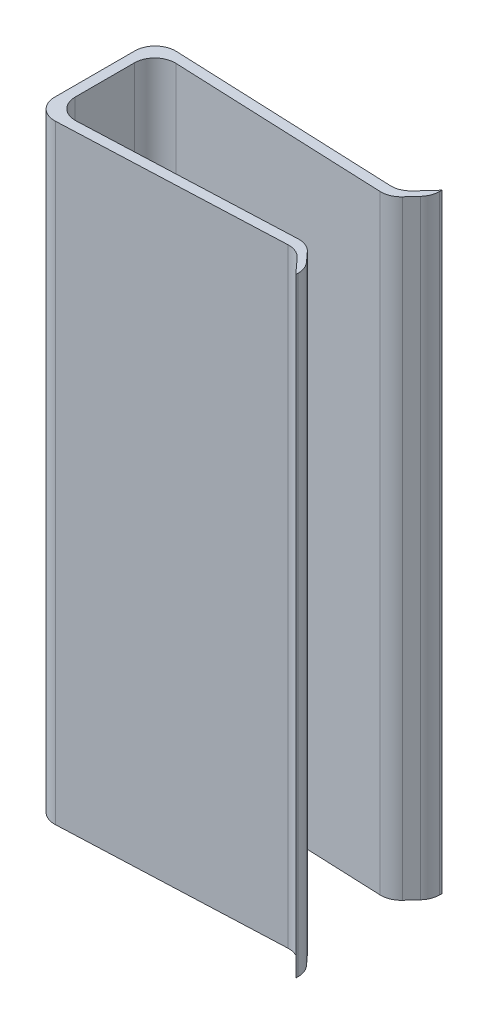
ISO-10303-21;
HEADER;
FILE_DESCRIPTION(('STEP AP214'),'2;1');
FILE_NAME('part.step','',(''),(''),'','','');
FILE_SCHEMA(('AUTOMOTIVE_DESIGN { 1 0 10303 214 1 1 1 1 }'));
ENDSEC;
DATA;
#1=APPLICATION_CONTEXT('core data for automotive mechanical design processes');
#2=APPLICATION_PROTOCOL_DEFINITION('international standard','automotive_design',2000,#1);
#3=PRODUCT_CONTEXT('',#1,'mechanical');
#4=PRODUCT('Part','Part','',(#3));
#5=PRODUCT_RELATED_PRODUCT_CATEGORY('part','',(#4));
#6=PRODUCT_DEFINITION_FORMATION('','',#4);
#7=PRODUCT_DEFINITION_CONTEXT('part definition',#1,'design');
#8=PRODUCT_DEFINITION('design','',#6,#7);
#9=PRODUCT_DEFINITION_SHAPE('','',#8);
#10=(LENGTH_UNIT() NAMED_UNIT(*) SI_UNIT(.MILLI.,.METRE.));
#11=(NAMED_UNIT(*) PLANE_ANGLE_UNIT() SI_UNIT($,.RADIAN.));
#12=(NAMED_UNIT(*) SI_UNIT($,.STERADIAN.) SOLID_ANGLE_UNIT());
#13=UNCERTAINTY_MEASURE_WITH_UNIT(LENGTH_MEASURE(1.E-05),#10,'distance_accuracy_value','');
#14=(GEOMETRIC_REPRESENTATION_CONTEXT(3) GLOBAL_UNCERTAINTY_ASSIGNED_CONTEXT((#13)) GLOBAL_UNIT_ASSIGNED_CONTEXT((#10,
#11,#12)) REPRESENTATION_CONTEXT('',''));
#15=CARTESIAN_POINT('',(0.,0.,0.));
#16=DIRECTION('',(0.,0.,1.));
#17=DIRECTION('',(1.,0.,0.));
#18=AXIS2_PLACEMENT_3D('',#15,#16,#17);
#19=CARTESIAN_POINT('',(6.,30.,2.5));
#20=DIRECTION('',(-0.0416305447121811,0.,-0.999133073092352));
#21=DIRECTION('',(-0.999133073092352,0.,0.0416305447121812));
#22=AXIS2_PLACEMENT_3D('',#19,#20,#21);
#23=PLANE('',#22);
#24=DIRECTION('',(0.999133073092352,0.,-0.0416305447121811));
#25=VECTOR('',#24,1.);
#26=CARTESIAN_POINT('',(6.,0.,2.5));
#27=LINE('',#26,#25);
#28=CARTESIAN_POINT('',(-5.45836945528782,0.,2.97743206063699));
#29=VERTEX_POINT('',#28);
#30=CARTESIAN_POINT('',(5.5340965965011,0.,2.51941264181245));
#31=VERTEX_POINT('',#30);
#32=EDGE_CURVE('E237',#29,#31,#27,.T.);
#33=ORIENTED_EDGE('',*,*,#32,.T.);
#34=DIRECTION('',(0.,-1.,0.));
#35=VECTOR('',#34,1.);
#36=CARTESIAN_POINT('',(5.5340965965011,30.,2.51941264181245));
#37=LINE('',#36,#35);
#38=CARTESIAN_POINT('',(5.5340965965011,30.,2.51941264181245));
#39=VERTEX_POINT('',#38);
#40=EDGE_CURVE('E326',#31,#39,#37,.F.);
#41=ORIENTED_EDGE('',*,*,#40,.T.);
#42=DIRECTION('',(0.999133073092352,0.,-0.0416305447121811));
#43=VECTOR('',#42,1.);
#44=CARTESIAN_POINT('',(6.,30.,2.5));
#45=LINE('',#44,#43);
#46=CARTESIAN_POINT('',(-5.45836945528782,30.,2.97743206063699));
#47=VERTEX_POINT('',#46);
#48=EDGE_CURVE('E195',#47,#39,#45,.T.);
#49=ORIENTED_EDGE('',*,*,#48,.F.);
#50=DIRECTION('',(0.,-1.,0.));
#51=VECTOR('',#50,1.);
#52=CARTESIAN_POINT('',(-5.45836945528782,30.,2.97743206063699));
#53=LINE('',#52,#51);
#54=EDGE_CURVE('E323',#47,#29,#53,.T.);
#55=ORIENTED_EDGE('',*,*,#54,.T.);
#56=EDGE_LOOP('',(#33,#41,#49,#55));
#57=FACE_BOUND('',#56,.T.);
#58=ADVANCED_FACE('F33',(#57),#23,.F.);
#59=CARTESIAN_POINT('',(7.,30.,3.59567943020749));
#60=DIRECTION('',(0.738620740253294,0.,-0.67412120725258));
#61=DIRECTION('',(-0.67412120725258,0.,-0.738620740253294));
#62=AXIS2_PLACEMENT_3D('',#59,#60,#61);
#63=PLANE('',#62);
#64=DIRECTION('',(0.67412120725258,0.,0.738620740253294));
#65=VECTOR('',#64,1.);
#66=CARTESIAN_POINT('',(7.,30.,3.59567943020749));
#67=LINE('',#66,#65);
#68=CARTESIAN_POINT('',(6.31434788146657,30.,2.84442450765223));
#69=VERTEX_POINT('',#68);
#70=CARTESIAN_POINT('',(7.,30.,3.59567943020749));
#71=VERTEX_POINT('',#70);
#72=EDGE_CURVE('E182',#69,#71,#67,.T.);
#73=ORIENTED_EDGE('',*,*,#72,.F.);
#74=DIRECTION('',(0.,-1.,0.));
#75=VECTOR('',#74,1.);
#76=CARTESIAN_POINT('',(6.31434788146657,0.,2.84442450765223));
#77=LINE('',#76,#75);
#78=CARTESIAN_POINT('',(6.31434788146657,0.,2.84442450765223));
#79=VERTEX_POINT('',#78);
#80=EDGE_CURVE('E321',#69,#79,#77,.T.);
#81=ORIENTED_EDGE('',*,*,#80,.T.);
#82=DIRECTION('',(0.67412120725258,0.,0.738620740253294));
#83=VECTOR('',#82,1.);
#84=CARTESIAN_POINT('',(7.,0.,3.59567943020749));
#85=LINE('',#84,#83);
#86=CARTESIAN_POINT('',(7.,0.,3.59567943020749));
#87=VERTEX_POINT('',#86);
#88=EDGE_CURVE('E201',#79,#87,#85,.T.);
#89=ORIENTED_EDGE('',*,*,#88,.T.);
#90=DIRECTION('',(0.,-1.,0.));
#91=VECTOR('',#90,1.);
#92=CARTESIAN_POINT('',(7.,30.,3.59567943020749));
#93=LINE('',#92,#91);
#94=EDGE_CURVE('E198',#71,#87,#93,.T.);
#95=ORIENTED_EDGE('',*,*,#94,.F.);
#96=EDGE_LOOP('',(#73,#81,#89,#95));
#97=FACE_BOUND('',#96,.T.);
#98=ADVANCED_FACE('F199',(#97),#63,.F.);
#99=CARTESIAN_POINT('',(7.,30.,3.09567943020749));
#100=DIRECTION('',(-1.,0.,0.));
#101=DIRECTION('',(0.,0.,1.));
#102=AXIS2_PLACEMENT_3D('',#99,#100,#101);
#103=PLANE('',#102);
#104=DIRECTION('',(0.,0.,-1.));
#105=VECTOR('',#104,1.);
#106=CARTESIAN_POINT('',(7.,0.,3.09567943020749));
#107=LINE('',#106,#105);
#108=CARTESIAN_POINT('',(7.,0.,3.48341275907275));
#109=VERTEX_POINT('',#108);
#110=EDGE_CURVE('E241',#87,#109,#107,.T.);
#111=ORIENTED_EDGE('',*,*,#110,.T.);
#112=DIRECTION('',(0.,-1.,0.));
#113=VECTOR('',#112,1.);
#114=CARTESIAN_POINT('',(7.,30.,3.48341275907275));
#115=LINE('',#114,#113);
#116=CARTESIAN_POINT('',(7.,30.,3.48341275907275));
#117=VERTEX_POINT('',#116);
#118=EDGE_CURVE('E210',#109,#117,#115,.F.);
#119=ORIENTED_EDGE('',*,*,#118,.T.);
#120=DIRECTION('',(0.,0.,-1.));
#121=VECTOR('',#120,1.);
#122=CARTESIAN_POINT('',(7.,30.,3.09567943020749));
#123=LINE('',#122,#121);
#124=EDGE_CURVE('E187',#71,#117,#123,.T.);
#125=ORIENTED_EDGE('',*,*,#124,.F.);
#126=ORIENTED_EDGE('',*,*,#94,.T.);
#127=EDGE_LOOP('',(#111,#119,#125,#126));
#128=FACE_BOUND('',#127,.T.);
#129=ADVANCED_FACE('F208',(#128),#103,.F.);
#130=CARTESIAN_POINT('',(6.,30.,2.));
#131=DIRECTION('',(-0.738620740253294,0.,0.67412120725258));
#132=DIRECTION('',(0.67412120725258,0.,0.738620740253294));
#133=AXIS2_PLACEMENT_3D('',#130,#131,#132);
#134=PLANE('',#133);
#135=DIRECTION('',(-0.67412120725258,0.,-0.738620740253294));
#136=VECTOR('',#135,1.);
#137=CARTESIAN_POINT('',(6.,0.,2.));
#138=LINE('',#137,#136);
#139=CARTESIAN_POINT('',(6.73862074025329,0.,2.80929155182017));
#140=VERTEX_POINT('',#139);
#141=CARTESIAN_POINT('',(6.31434788146657,0.,2.34442450765223));
#142=VERTEX_POINT('',#141);
#143=EDGE_CURVE('E243',#140,#142,#138,.T.);
#144=ORIENTED_EDGE('',*,*,#143,.T.);
#145=DIRECTION('',(0.,-1.,0.));
#146=VECTOR('',#145,1.);
#147=CARTESIAN_POINT('',(6.31434788146657,30.,2.34442450765223));
#148=LINE('',#147,#146);
#149=CARTESIAN_POINT('',(6.31434788146657,30.,2.34442450765223));
#150=VERTEX_POINT('',#149);
#151=EDGE_CURVE('E299',#142,#150,#148,.F.);
#152=ORIENTED_EDGE('',*,*,#151,.T.);
#153=DIRECTION('',(-0.67412120725258,0.,-0.738620740253294));
#154=VECTOR('',#153,1.);
#155=CARTESIAN_POINT('',(6.,30.,2.));
#156=LINE('',#155,#154);
#157=CARTESIAN_POINT('',(6.73862074025329,30.,2.80929155182017));
#158=VERTEX_POINT('',#157);
#159=EDGE_CURVE('E211',#158,#150,#156,.T.);
#160=ORIENTED_EDGE('',*,*,#159,.F.);
#161=DIRECTION('',(0.,-1.,0.));
#162=VECTOR('',#161,1.);
#163=CARTESIAN_POINT('',(6.73862074025329,30.,2.80929155182017));
#164=LINE('',#163,#162);
#165=EDGE_CURVE('E296',#158,#140,#164,.T.);
#166=ORIENTED_EDGE('',*,*,#165,.T.);
#167=EDGE_LOOP('',(#144,#152,#160,#166));
#168=FACE_BOUND('',#167,.T.);
#169=ADVANCED_FACE('F389',(#168),#134,.F.);
#170=CARTESIAN_POINT('',(-6.,30.,2.5));
#171=DIRECTION('',(0.0416305447121813,0.,0.999133073092352));
#172=DIRECTION('',(0.999133073092352,0.,-0.0416305447121813));
#173=AXIS2_PLACEMENT_3D('',#170,#171,#172);
#174=PLANE('',#173);
#175=DIRECTION('',(-0.999133073092352,0.,0.0416305447121813));
#176=VECTOR('',#175,1.);
#177=CARTESIAN_POINT('',(-6.,0.,2.5));
#178=LINE('',#177,#176);
#179=CARTESIAN_POINT('',(5.5340965965011,0.,2.01941264181245));
#180=VERTEX_POINT('',#179);
#181=CARTESIAN_POINT('',(-4.95836945528782,0.,2.45659872730366));
#182=VERTEX_POINT('',#181);
#183=EDGE_CURVE('E246',#180,#182,#178,.T.);
#184=ORIENTED_EDGE('',*,*,#183,.T.);
#185=DIRECTION('',(0.,-1.,0.));
#186=VECTOR('',#185,1.);
#187=CARTESIAN_POINT('',(-4.95836945528782,30.,2.45659872730366));
#188=LINE('',#187,#186);
#189=CARTESIAN_POINT('',(-4.95836945528782,30.,2.45659872730366));
#190=VERTEX_POINT('',#189);
#191=EDGE_CURVE('E277',#182,#190,#188,.F.);
#192=ORIENTED_EDGE('',*,*,#191,.T.);
#193=DIRECTION('',(-0.999133073092352,0.,0.0416305447121813));
#194=VECTOR('',#193,1.);
#195=CARTESIAN_POINT('',(-6.,30.,2.5));
#196=LINE('',#195,#194);
#197=CARTESIAN_POINT('',(5.5340965965011,30.,2.01941264181245));
#198=VERTEX_POINT('',#197);
#199=EDGE_CURVE('E213',#198,#190,#196,.T.);
#200=ORIENTED_EDGE('',*,*,#199,.F.);
#201=DIRECTION('',(0.,-1.,0.));
#202=VECTOR('',#201,1.);
#203=CARTESIAN_POINT('',(5.5340965965011,30.,2.01941264181245));
#204=LINE('',#203,#202);
#205=EDGE_CURVE('E274',#198,#180,#204,.T.);
#206=ORIENTED_EDGE('',*,*,#205,.T.);
#207=EDGE_LOOP('',(#184,#192,#200,#206));
#208=FACE_BOUND('',#207,.T.);
#209=ADVANCED_FACE('F397',(#208),#174,.F.);
#210=CARTESIAN_POINT('',(-6.,30.,2.5));
#211=DIRECTION('',(-1.,0.,0.));
#212=DIRECTION('',(0.,0.,1.));
#213=AXIS2_PLACEMENT_3D('',#210,#211,#212);
#214=PLANE('',#213);
#215=DIRECTION('',(0.,0.,-1.));
#216=VECTOR('',#215,1.);
#217=CARTESIAN_POINT('',(-6.,30.,2.5));
#218=LINE('',#217,#216);
#219=CARTESIAN_POINT('',(-6.,30.,1.45746565421131));
#220=VERTEX_POINT('',#219);
#221=CARTESIAN_POINT('',(-6.,30.,-1.45746565421131));
#222=VERTEX_POINT('',#221);
#223=EDGE_CURVE('E219',#220,#222,#218,.T.);
#224=ORIENTED_EDGE('',*,*,#223,.F.);
#225=DIRECTION('',(0.,-1.,0.));
#226=VECTOR('',#225,1.);
#227=CARTESIAN_POINT('',(-6.,0.,1.45746565421131));
#228=LINE('',#227,#226);
#229=CARTESIAN_POINT('',(-6.,0.,1.45746565421131));
#230=VERTEX_POINT('',#229);
#231=EDGE_CURVE('E271',#220,#230,#228,.T.);
#232=ORIENTED_EDGE('',*,*,#231,.T.);
#233=DIRECTION('',(0.,0.,-1.));
#234=VECTOR('',#233,1.);
#235=CARTESIAN_POINT('',(-6.,0.,2.5));
#236=LINE('',#235,#234);
#237=CARTESIAN_POINT('',(-6.,0.,-1.45746565421131));
#238=VERTEX_POINT('',#237);
#239=EDGE_CURVE('E249',#230,#238,#236,.T.);
#240=ORIENTED_EDGE('',*,*,#239,.T.);
#241=DIRECTION('',(0.,-1.,0.));
#242=VECTOR('',#241,1.);
#243=CARTESIAN_POINT('',(-6.,30.,-1.45746565421131));
#244=LINE('',#243,#242);
#245=EDGE_CURVE('E205',#238,#222,#244,.F.);
#246=ORIENTED_EDGE('',*,*,#245,.T.);
#247=EDGE_LOOP('',(#224,#232,#240,#246));
#248=FACE_BOUND('',#247,.T.);
#249=ADVANCED_FACE('F405',(#248),#214,.F.);
#250=CARTESIAN_POINT('',(-6.,30.,-2.5));
#251=DIRECTION('',(0.0416305447121813,0.,-0.999133073092352));
#252=DIRECTION('',(-0.999133073092352,0.,-0.0416305447121813));
#253=AXIS2_PLACEMENT_3D('',#250,#251,#252);
#254=PLANE('',#253);
#255=DIRECTION('',(0.999133073092352,0.,0.0416305447121813));
#256=VECTOR('',#255,1.);
#257=CARTESIAN_POINT('',(-6.,30.,-2.5));
#258=LINE('',#257,#256);
#259=CARTESIAN_POINT('',(-4.95836945528782,30.,-2.45659872730366));
#260=VERTEX_POINT('',#259);
#261=CARTESIAN_POINT('',(5.5340965965011,30.,-2.01941264181245));
#262=VERTEX_POINT('',#261);
#263=EDGE_CURVE('E222',#260,#262,#258,.T.);
#264=ORIENTED_EDGE('',*,*,#263,.F.);
#265=DIRECTION('',(0.,-1.,0.));
#266=VECTOR('',#265,1.);
#267=CARTESIAN_POINT('',(-4.95836945528782,0.,-2.45659872730366));
#268=LINE('',#267,#266);
#269=CARTESIAN_POINT('',(-4.95836945528782,0.,-2.45659872730366));
#270=VERTEX_POINT('',#269);
#271=EDGE_CURVE('E281',#260,#270,#268,.T.);
#272=ORIENTED_EDGE('',*,*,#271,.T.);
#273=DIRECTION('',(0.999133073092352,0.,0.0416305447121813));
#274=VECTOR('',#273,1.);
#275=CARTESIAN_POINT('',(-6.,0.,-2.5));
#276=LINE('',#275,#274);
#277=CARTESIAN_POINT('',(5.5340965965011,0.,-2.01941264181245));
#278=VERTEX_POINT('',#277);
#279=EDGE_CURVE('E252',#270,#278,#276,.T.);
#280=ORIENTED_EDGE('',*,*,#279,.T.);
#281=DIRECTION('',(0.,-1.,0.));
#282=VECTOR('',#281,1.);
#283=CARTESIAN_POINT('',(5.5340965965011,30.,-2.01941264181245));
#284=LINE('',#283,#282);
#285=EDGE_CURVE('E279',#278,#262,#284,.F.);
#286=ORIENTED_EDGE('',*,*,#285,.T.);
#287=EDGE_LOOP('',(#264,#272,#280,#286));
#288=FACE_BOUND('',#287,.T.);
#289=ADVANCED_FACE('F414',(#288),#254,.F.);
#290=CARTESIAN_POINT('',(6.,30.,-2.));
#291=DIRECTION('',(-0.738620740253294,0.,-0.67412120725258));
#292=DIRECTION('',(-0.67412120725258,0.,0.738620740253294));
#293=AXIS2_PLACEMENT_3D('',#290,#291,#292);
#294=PLANE('',#293);
#295=DIRECTION('',(0.67412120725258,0.,-0.738620740253294));
#296=VECTOR('',#295,1.);
#297=CARTESIAN_POINT('',(6.,0.,-2.));
#298=LINE('',#297,#296);
#299=CARTESIAN_POINT('',(6.31434788146657,0.,-2.34442450765223));
#300=VERTEX_POINT('',#299);
#301=CARTESIAN_POINT('',(6.73862074025329,0.,-2.80929155182017));
#302=VERTEX_POINT('',#301);
#303=EDGE_CURVE('E255',#300,#302,#298,.T.);
#304=ORIENTED_EDGE('',*,*,#303,.T.);
#305=DIRECTION('',(0.,-1.,0.));
#306=VECTOR('',#305,1.);
#307=CARTESIAN_POINT('',(6.73862074025329,30.,-2.80929155182017));
#308=LINE('',#307,#306);
#309=CARTESIAN_POINT('',(6.73862074025329,30.,-2.80929155182017));
#310=VERTEX_POINT('',#309);
#311=EDGE_CURVE('E318',#302,#310,#308,.F.);
#312=ORIENTED_EDGE('',*,*,#311,.T.);
#313=DIRECTION('',(0.67412120725258,0.,-0.738620740253294));
#314=VECTOR('',#313,1.);
#315=CARTESIAN_POINT('',(6.,30.,-2.));
#316=LINE('',#315,#314);
#317=CARTESIAN_POINT('',(6.31434788146657,30.,-2.34442450765223));
#318=VERTEX_POINT('',#317);
#319=EDGE_CURVE('E225',#318,#310,#316,.T.);
#320=ORIENTED_EDGE('',*,*,#319,.F.);
#321=DIRECTION('',(0.,-1.,0.));
#322=VECTOR('',#321,1.);
#323=CARTESIAN_POINT('',(6.31434788146657,30.,-2.34442450765223));
#324=LINE('',#323,#322);
#325=EDGE_CURVE('E315',#318,#300,#324,.T.);
#326=ORIENTED_EDGE('',*,*,#325,.T.);
#327=EDGE_LOOP('',(#304,#312,#320,#326));
#328=FACE_BOUND('',#327,.T.);
#329=ADVANCED_FACE('F423',(#328),#294,.F.);
#330=CARTESIAN_POINT('',(7.,30.,-3.09567943020749));
#331=DIRECTION('',(-1.,0.,0.));
#332=DIRECTION('',(0.,0.,1.));
#333=AXIS2_PLACEMENT_3D('',#330,#331,#332);
#334=PLANE('',#333);
#335=DIRECTION('',(0.,0.,-1.));
#336=VECTOR('',#335,1.);
#337=CARTESIAN_POINT('',(7.,30.,-3.09567943020749));
#338=LINE('',#337,#336);
#339=CARTESIAN_POINT('',(7.,30.,-3.48341275907275));
#340=VERTEX_POINT('',#339);
#341=CARTESIAN_POINT('',(7.,30.,-3.59567943020749));
#342=VERTEX_POINT('',#341);
#343=EDGE_CURVE('E228',#340,#342,#338,.T.);
#344=ORIENTED_EDGE('',*,*,#343,.F.);
#345=DIRECTION('',(0.,-1.,0.));
#346=VECTOR('',#345,1.);
#347=CARTESIAN_POINT('',(7.,30.,-3.48341275907275));
#348=LINE('',#347,#346);
#349=CARTESIAN_POINT('',(7.,0.,-3.48341275907275));
#350=VERTEX_POINT('',#349);
#351=EDGE_CURVE('E312',#340,#350,#348,.T.);
#352=ORIENTED_EDGE('',*,*,#351,.T.);
#353=DIRECTION('',(0.,0.,-1.));
#354=VECTOR('',#353,1.);
#355=CARTESIAN_POINT('',(7.,0.,-3.09567943020749));
#356=LINE('',#355,#354);
#357=CARTESIAN_POINT('',(7.,0.,-3.59567943020749));
#358=VERTEX_POINT('',#357);
#359=EDGE_CURVE('E258',#350,#358,#356,.T.);
#360=ORIENTED_EDGE('',*,*,#359,.T.);
#361=DIRECTION('',(0.,-1.,0.));
#362=VECTOR('',#361,1.);
#363=CARTESIAN_POINT('',(7.,30.,-3.59567943020749));
#364=LINE('',#363,#362);
#365=EDGE_CURVE('E206',#342,#358,#364,.T.);
#366=ORIENTED_EDGE('',*,*,#365,.F.);
#367=EDGE_LOOP('',(#344,#352,#360,#366));
#368=FACE_BOUND('',#367,.T.);
#369=ADVANCED_FACE('F431',(#368),#334,.F.);
#370=CARTESIAN_POINT('',(7.,30.,-3.59567943020749));
#371=DIRECTION('',(0.738620740253294,0.,0.67412120725258));
#372=DIRECTION('',(0.67412120725258,0.,-0.738620740253294));
#373=AXIS2_PLACEMENT_3D('',#370,#371,#372);
#374=PLANE('',#373);
#375=DIRECTION('',(-0.67412120725258,0.,0.738620740253294));
#376=VECTOR('',#375,1.);
#377=CARTESIAN_POINT('',(7.,0.,-3.59567943020749));
#378=LINE('',#377,#376);
#379=CARTESIAN_POINT('',(6.31434788146657,0.,-2.84442450765223));
#380=VERTEX_POINT('',#379);
#381=EDGE_CURVE('E260',#358,#380,#378,.T.);
#382=ORIENTED_EDGE('',*,*,#381,.T.);
#383=DIRECTION('',(0.,-1.,0.));
#384=VECTOR('',#383,1.);
#385=CARTESIAN_POINT('',(6.31434788146657,30.,-2.84442450765223));
#386=LINE('',#385,#384);
#387=CARTESIAN_POINT('',(6.31434788146657,30.,-2.84442450765223));
#388=VERTEX_POINT('',#387);
#389=EDGE_CURVE('E333',#380,#388,#386,.F.);
#390=ORIENTED_EDGE('',*,*,#389,.T.);
#391=DIRECTION('',(-0.67412120725258,0.,0.738620740253294));
#392=VECTOR('',#391,1.);
#393=CARTESIAN_POINT('',(7.,30.,-3.59567943020749));
#394=LINE('',#393,#392);
#395=EDGE_CURVE('E230',#342,#388,#394,.T.);
#396=ORIENTED_EDGE('',*,*,#395,.F.);
#397=ORIENTED_EDGE('',*,*,#365,.T.);
#398=EDGE_LOOP('',(#382,#390,#396,#397));
#399=FACE_BOUND('',#398,.T.);
#400=ADVANCED_FACE('F359',(#399),#374,.F.);
#401=CARTESIAN_POINT('',(6.,30.,-2.5));
#402=DIRECTION('',(-0.0416305447121811,0.,0.999133073092352));
#403=DIRECTION('',(0.999133073092352,0.,0.0416305447121812));
#404=AXIS2_PLACEMENT_3D('',#401,#402,#403);
#405=PLANE('',#404);
#406=DIRECTION('',(-0.999133073092352,0.,-0.0416305447121811));
#407=VECTOR('',#406,1.);
#408=CARTESIAN_POINT('',(6.,30.,-2.5));
#409=LINE('',#408,#407);
#410=CARTESIAN_POINT('',(5.5340965965011,30.,-2.51941264181245));
#411=VERTEX_POINT('',#410);
#412=CARTESIAN_POINT('',(-5.45836945528782,30.,-2.97743206063699));
#413=VERTEX_POINT('',#412);
#414=EDGE_CURVE('E233',#411,#413,#409,.T.);
#415=ORIENTED_EDGE('',*,*,#414,.F.);
#416=DIRECTION('',(0.,-1.,0.));
#417=VECTOR('',#416,1.);
#418=CARTESIAN_POINT('',(5.5340965965011,0.,-2.51941264181245));
#419=LINE('',#418,#417);
#420=CARTESIAN_POINT('',(5.5340965965011,0.,-2.51941264181245));
#421=VERTEX_POINT('',#420);
#422=EDGE_CURVE('E330',#411,#421,#419,.T.);
#423=ORIENTED_EDGE('',*,*,#422,.T.);
#424=DIRECTION('',(-0.999133073092352,0.,-0.0416305447121811));
#425=VECTOR('',#424,1.);
#426=CARTESIAN_POINT('',(6.,0.,-2.5));
#427=LINE('',#426,#425);
#428=CARTESIAN_POINT('',(-5.45836945528782,0.,-2.97743206063699));
#429=VERTEX_POINT('',#428);
#430=EDGE_CURVE('E263',#421,#429,#427,.T.);
#431=ORIENTED_EDGE('',*,*,#430,.T.);
#432=DIRECTION('',(0.,-1.,0.));
#433=VECTOR('',#432,1.);
#434=CARTESIAN_POINT('',(-5.45836945528782,30.,-2.97743206063699));
#435=LINE('',#434,#433);
#436=EDGE_CURVE('E328',#429,#413,#435,.F.);
#437=ORIENTED_EDGE('',*,*,#436,.T.);
#438=EDGE_LOOP('',(#415,#423,#431,#437));
#439=FACE_BOUND('',#438,.T.);
#440=ADVANCED_FACE('F366',(#439),#405,.F.);
#441=CARTESIAN_POINT('',(-6.5,30.,3.02083333333333));
#442=DIRECTION('',(1.,0.,0.));
#443=DIRECTION('',(0.,0.,-1.));
#444=AXIS2_PLACEMENT_3D('',#441,#442,#443);
#445=PLANE('',#444);
#446=DIRECTION('',(0.,0.,1.));
#447=VECTOR('',#446,1.);
#448=CARTESIAN_POINT('',(-6.5,0.,3.02083333333333));
#449=LINE('',#448,#447);
#450=CARTESIAN_POINT('',(-6.5,0.,-1.97829898754464));
#451=VERTEX_POINT('',#450);
#452=CARTESIAN_POINT('',(-6.5,0.,1.97829898754464));
#453=VERTEX_POINT('',#452);
#454=EDGE_CURVE('E266',#451,#453,#449,.T.);
#455=ORIENTED_EDGE('',*,*,#454,.T.);
#456=DIRECTION('',(0.,-1.,0.));
#457=VECTOR('',#456,1.);
#458=CARTESIAN_POINT('',(-6.5,30.,1.97829898754464));
#459=LINE('',#458,#457);
#460=CARTESIAN_POINT('',(-6.5,30.,1.97829898754464));
#461=VERTEX_POINT('',#460);
#462=EDGE_CURVE('E48',#453,#461,#459,.F.);
#463=ORIENTED_EDGE('',*,*,#462,.T.);
#464=DIRECTION('',(0.,0.,1.));
#465=VECTOR('',#464,1.);
#466=CARTESIAN_POINT('',(-6.5,30.,3.02083333333333));
#467=LINE('',#466,#465);
#468=CARTESIAN_POINT('',(-6.5,30.,-1.97829898754464));
#469=VERTEX_POINT('',#468);
#470=EDGE_CURVE('E235',#469,#461,#467,.T.);
#471=ORIENTED_EDGE('',*,*,#470,.F.);
#472=DIRECTION('',(0.,-1.,0.));
#473=VECTOR('',#472,1.);
#474=CARTESIAN_POINT('',(-6.5,30.,-1.97829898754464));
#475=LINE('',#474,#473);
#476=EDGE_CURVE('E335',#469,#451,#475,.T.);
#477=ORIENTED_EDGE('',*,*,#476,.T.);
#478=EDGE_LOOP('',(#455,#463,#471,#477));
#479=FACE_BOUND('',#478,.T.);
#480=ADVANCED_FACE('F371',(#479),#445,.F.);
#481=CARTESIAN_POINT('',(0.,30.,0.));
#482=DIRECTION('',(0.,-1.,0.));
#483=DIRECTION('',(0.,0.,-1.));
#484=AXIS2_PLACEMENT_3D('',#481,#482,#483);
#485=PLANE('',#484);
#486=ORIENTED_EDGE('',*,*,#159,.T.);
#487=CARTESIAN_POINT('',(5.57572714121328,30.,3.0185457149048));
#488=DIRECTION('',(0.,-1.,0.));
#489=DIRECTION('',(0.,0.,-1.));
#490=AXIS2_PLACEMENT_3D('',#487,#488,#489);
#491=CIRCLE('',#490,0.999999999999997);
#492=EDGE_CURVE('E310',#150,#198,#491,.F.);
#493=ORIENTED_EDGE('',*,*,#492,.T.);
#494=ORIENTED_EDGE('',*,*,#199,.T.);
#495=CARTESIAN_POINT('',(-5.,30.,1.45746565421131));
#496=DIRECTION('',(0.,-1.,0.));
#497=DIRECTION('',(0.,0.,-1.));
#498=AXIS2_PLACEMENT_3D('',#495,#496,#497);
#499=CIRCLE('',#498,0.999999999999997);
#500=EDGE_CURVE('E341',#190,#220,#499,.T.);
#501=ORIENTED_EDGE('',*,*,#500,.T.);
#502=ORIENTED_EDGE('',*,*,#223,.T.);
#503=CARTESIAN_POINT('',(-5.,30.,-1.45746565421131));
#504=DIRECTION('',(0.,-1.,0.));
#505=DIRECTION('',(0.,0.,-1.));
#506=AXIS2_PLACEMENT_3D('',#503,#504,#505);
#507=CIRCLE('',#506,0.999999999999997);
#508=EDGE_CURVE('E345',#222,#260,#507,.T.);
#509=ORIENTED_EDGE('',*,*,#508,.T.);
#510=ORIENTED_EDGE('',*,*,#263,.T.);
#511=CARTESIAN_POINT('',(5.57572714121328,30.,-3.0185457149048));
#512=DIRECTION('',(0.,-1.,0.));
#513=DIRECTION('',(0.,0.,-1.));
#514=AXIS2_PLACEMENT_3D('',#511,#512,#513);
#515=CIRCLE('',#514,0.999999999999997);
#516=EDGE_CURVE('E304',#262,#318,#515,.F.);
#517=ORIENTED_EDGE('',*,*,#516,.T.);
#518=ORIENTED_EDGE('',*,*,#319,.T.);
#519=CARTESIAN_POINT('',(6.,30.,-3.48341275907275));
#520=DIRECTION('',(0.,-1.,0.));
#521=DIRECTION('',(0.,0.,-1.));
#522=AXIS2_PLACEMENT_3D('',#519,#520,#521);
#523=CIRCLE('',#522,0.999999999999997);
#524=EDGE_CURVE('E308',#310,#340,#523,.F.);
#525=ORIENTED_EDGE('',*,*,#524,.T.);
#526=ORIENTED_EDGE('',*,*,#343,.T.);
#527=ORIENTED_EDGE('',*,*,#395,.T.);
#528=CARTESIAN_POINT('',(5.57572714121328,30.,-3.5185457149048));
#529=DIRECTION('',(0.,-1.,0.));
#530=DIRECTION('',(0.,0.,-1.));
#531=AXIS2_PLACEMENT_3D('',#528,#529,#530);
#532=CIRCLE('',#531,0.999999999999997);
#533=EDGE_CURVE('E11',#388,#411,#532,.T.);
#534=ORIENTED_EDGE('',*,*,#533,.T.);
#535=ORIENTED_EDGE('',*,*,#414,.T.);
#536=CARTESIAN_POINT('',(-5.5,30.,-1.97829898754464));
#537=DIRECTION('',(0.,-1.,0.));
#538=DIRECTION('',(0.,0.,-1.));
#539=AXIS2_PLACEMENT_3D('',#536,#537,#538);
#540=CIRCLE('',#539,0.999999999999997);
#541=EDGE_CURVE('E55',#413,#469,#540,.F.);
#542=ORIENTED_EDGE('',*,*,#541,.T.);
#543=ORIENTED_EDGE('',*,*,#470,.T.);
#544=CARTESIAN_POINT('',(-5.5,30.,1.97829898754464));
#545=DIRECTION('',(0.,-1.,0.));
#546=DIRECTION('',(0.,0.,-1.));
#547=AXIS2_PLACEMENT_3D('',#544,#545,#546);
#548=CIRCLE('',#547,0.999999999999997);
#549=EDGE_CURVE('E302',#461,#47,#548,.F.);
#550=ORIENTED_EDGE('',*,*,#549,.T.);
#551=ORIENTED_EDGE('',*,*,#48,.T.);
#552=CARTESIAN_POINT('',(5.57572714121328,30.,3.5185457149048));
#553=DIRECTION('',(0.,-1.,0.));
#554=DIRECTION('',(0.,0.,-1.));
#555=AXIS2_PLACEMENT_3D('',#552,#553,#554);
#556=CIRCLE('',#555,0.999999999999997);
#557=EDGE_CURVE('E191',#39,#69,#556,.T.);
#558=ORIENTED_EDGE('',*,*,#557,.T.);
#559=ORIENTED_EDGE('',*,*,#72,.T.);
#560=ORIENTED_EDGE('',*,*,#124,.T.);
#561=CARTESIAN_POINT('',(6.,30.,3.48341275907275));
#562=DIRECTION('',(0.,-1.,0.));
#563=DIRECTION('',(0.,0.,-1.));
#564=AXIS2_PLACEMENT_3D('',#561,#562,#563);
#565=CIRCLE('',#564,0.999999999999997);
#566=EDGE_CURVE('E306',#117,#158,#565,.F.);
#567=ORIENTED_EDGE('',*,*,#566,.T.);
#568=EDGE_LOOP('',(#486,#493,#494,#501,#502,#509,#510,#517,#518,#525,#526,#527,#534,#535,#542,
#543,#550,#551,#558,#559,#560,#567));
#569=FACE_BOUND('',#568,.T.);
#570=ADVANCED_FACE('F185',(#569),#485,.F.);
#571=CARTESIAN_POINT('',(0.,0.,0.));
#572=DIRECTION('',(0.,-1.,0.));
#573=DIRECTION('',(0.,0.,-1.));
#574=AXIS2_PLACEMENT_3D('',#571,#572,#573);
#575=PLANE('',#574);
#576=ORIENTED_EDGE('',*,*,#183,.F.);
#577=CARTESIAN_POINT('',(5.57572714121328,0.,3.0185457149048));
#578=DIRECTION('',(0.,-1.,0.));
#579=DIRECTION('',(0.,0.,-1.));
#580=AXIS2_PLACEMENT_3D('',#577,#578,#579);
#581=CIRCLE('',#580,0.999999999999997);
#582=EDGE_CURVE('E294',#180,#142,#581,.T.);
#583=ORIENTED_EDGE('',*,*,#582,.T.);
#584=ORIENTED_EDGE('',*,*,#143,.F.);
#585=CARTESIAN_POINT('',(6.,0.,3.48341275907275));
#586=DIRECTION('',(0.,-1.,0.));
#587=DIRECTION('',(0.,0.,-1.));
#588=AXIS2_PLACEMENT_3D('',#585,#586,#587);
#589=CIRCLE('',#588,0.999999999999997);
#590=EDGE_CURVE('E290',#140,#109,#589,.T.);
#591=ORIENTED_EDGE('',*,*,#590,.T.);
#592=ORIENTED_EDGE('',*,*,#110,.F.);
#593=ORIENTED_EDGE('',*,*,#88,.F.);
#594=CARTESIAN_POINT('',(5.57572714121328,0.,3.5185457149048));
#595=DIRECTION('',(0.,-1.,0.));
#596=DIRECTION('',(0.,0.,-1.));
#597=AXIS2_PLACEMENT_3D('',#594,#595,#596);
#598=CIRCLE('',#597,0.999999999999997);
#599=EDGE_CURVE('E347',#79,#31,#598,.F.);
#600=ORIENTED_EDGE('',*,*,#599,.T.);
#601=ORIENTED_EDGE('',*,*,#32,.F.);
#602=CARTESIAN_POINT('',(-5.5,0.,1.97829898754464));
#603=DIRECTION('',(0.,-1.,0.));
#604=DIRECTION('',(0.,0.,-1.));
#605=AXIS2_PLACEMENT_3D('',#602,#603,#604);
#606=CIRCLE('',#605,0.999999999999997);
#607=EDGE_CURVE('E286',#29,#453,#606,.T.);
#608=ORIENTED_EDGE('',*,*,#607,.T.);
#609=ORIENTED_EDGE('',*,*,#454,.F.);
#610=CARTESIAN_POINT('',(-5.5,0.,-1.97829898754464));
#611=DIRECTION('',(0.,-1.,0.));
#612=DIRECTION('',(0.,0.,-1.));
#613=AXIS2_PLACEMENT_3D('',#610,#611,#612);
#614=CIRCLE('',#613,0.999999999999997);
#615=EDGE_CURVE('E284',#451,#429,#614,.T.);
#616=ORIENTED_EDGE('',*,*,#615,.T.);
#617=ORIENTED_EDGE('',*,*,#430,.F.);
#618=CARTESIAN_POINT('',(5.57572714121328,0.,-3.5185457149048));
#619=DIRECTION('',(0.,-1.,0.));
#620=DIRECTION('',(0.,0.,-1.));
#621=AXIS2_PLACEMENT_3D('',#618,#619,#620);
#622=CIRCLE('',#621,0.999999999999997);
#623=EDGE_CURVE('E41',#421,#380,#622,.F.);
#624=ORIENTED_EDGE('',*,*,#623,.T.);
#625=ORIENTED_EDGE('',*,*,#381,.F.);
#626=ORIENTED_EDGE('',*,*,#359,.F.);
#627=CARTESIAN_POINT('',(6.,0.,-3.48341275907275));
#628=DIRECTION('',(0.,-1.,0.));
#629=DIRECTION('',(0.,0.,-1.));
#630=AXIS2_PLACEMENT_3D('',#627,#628,#629);
#631=CIRCLE('',#630,0.999999999999997);
#632=EDGE_CURVE('E292',#350,#302,#631,.T.);
#633=ORIENTED_EDGE('',*,*,#632,.T.);
#634=ORIENTED_EDGE('',*,*,#303,.F.);
#635=CARTESIAN_POINT('',(5.57572714121328,0.,-3.0185457149048));
#636=DIRECTION('',(0.,-1.,0.));
#637=DIRECTION('',(0.,0.,-1.));
#638=AXIS2_PLACEMENT_3D('',#635,#636,#637);
#639=CIRCLE('',#638,0.999999999999997);
#640=EDGE_CURVE('E288',#300,#278,#639,.T.);
#641=ORIENTED_EDGE('',*,*,#640,.T.);
#642=ORIENTED_EDGE('',*,*,#279,.F.);
#643=CARTESIAN_POINT('',(-5.,0.,-1.45746565421131));
#644=DIRECTION('',(0.,-1.,0.));
#645=DIRECTION('',(0.,0.,-1.));
#646=AXIS2_PLACEMENT_3D('',#643,#644,#645);
#647=CIRCLE('',#646,0.999999999999997);
#648=EDGE_CURVE('E343',#270,#238,#647,.F.);
#649=ORIENTED_EDGE('',*,*,#648,.T.);
#650=ORIENTED_EDGE('',*,*,#239,.F.);
#651=CARTESIAN_POINT('',(-5.,0.,1.45746565421131));
#652=DIRECTION('',(0.,-1.,0.));
#653=DIRECTION('',(0.,0.,-1.));
#654=AXIS2_PLACEMENT_3D('',#651,#652,#653);
#655=CIRCLE('',#654,0.999999999999997);
#656=EDGE_CURVE('E339',#230,#182,#655,.F.);
#657=ORIENTED_EDGE('',*,*,#656,.T.);
#658=EDGE_LOOP('',(#576,#583,#584,#591,#592,#593,#600,#601,#608,#609,#616,#617,#624,#625,#626,
#633,#634,#641,#642,#649,#650,#657));
#659=FACE_BOUND('',#658,.T.);
#660=ADVANCED_FACE('F353',(#659),#575,.T.);
#661=CARTESIAN_POINT('',(-5.,30.,1.45746565421131));
#662=DIRECTION('',(0.,1.,0.));
#663=DIRECTION('',(0.,0.,1.));
#664=AXIS2_PLACEMENT_3D('',#661,#662,#663);
#665=CYLINDRICAL_SURFACE('',#664,0.999999999999997);
#666=ORIENTED_EDGE('',*,*,#500,.F.);
#667=ORIENTED_EDGE('',*,*,#191,.F.);
#668=ORIENTED_EDGE('',*,*,#656,.F.);
#669=ORIENTED_EDGE('',*,*,#231,.F.);
#670=EDGE_LOOP('',(#666,#667,#668,#669));
#671=FACE_BOUND('',#670,.T.);
#672=ADVANCED_FACE('F400',(#671),#665,.F.);
#673=CARTESIAN_POINT('',(-5.,30.,-1.45746565421131));
#674=DIRECTION('',(0.,1.,0.));
#675=DIRECTION('',(0.,0.,1.));
#676=AXIS2_PLACEMENT_3D('',#673,#674,#675);
#677=CYLINDRICAL_SURFACE('',#676,0.999999999999997);
#678=ORIENTED_EDGE('',*,*,#508,.F.);
#679=ORIENTED_EDGE('',*,*,#245,.F.);
#680=ORIENTED_EDGE('',*,*,#648,.F.);
#681=ORIENTED_EDGE('',*,*,#271,.F.);
#682=EDGE_LOOP('',(#678,#679,#680,#681));
#683=FACE_BOUND('',#682,.T.);
#684=ADVANCED_FACE('F409',(#683),#677,.F.);
#685=CARTESIAN_POINT('',(5.57572714121328,30.,3.0185457149048));
#686=DIRECTION('',(0.,-1.,0.));
#687=DIRECTION('',(0.,0.,-1.));
#688=AXIS2_PLACEMENT_3D('',#685,#686,#687);
#689=CYLINDRICAL_SURFACE('',#688,0.999999999999997);
#690=ORIENTED_EDGE('',*,*,#492,.F.);
#691=ORIENTED_EDGE('',*,*,#151,.F.);
#692=ORIENTED_EDGE('',*,*,#582,.F.);
#693=ORIENTED_EDGE('',*,*,#205,.F.);
#694=EDGE_LOOP('',(#690,#691,#692,#693));
#695=FACE_BOUND('',#694,.T.);
#696=ADVANCED_FACE('F392',(#695),#689,.T.);
#697=CARTESIAN_POINT('',(6.,30.,-3.48341275907275));
#698=DIRECTION('',(0.,-1.,0.));
#699=DIRECTION('',(0.,0.,-1.));
#700=AXIS2_PLACEMENT_3D('',#697,#698,#699);
#701=CYLINDRICAL_SURFACE('',#700,0.999999999999997);
#702=ORIENTED_EDGE('',*,*,#524,.F.);
#703=ORIENTED_EDGE('',*,*,#311,.F.);
#704=ORIENTED_EDGE('',*,*,#632,.F.);
#705=ORIENTED_EDGE('',*,*,#351,.F.);
#706=EDGE_LOOP('',(#702,#703,#704,#705));
#707=FACE_BOUND('',#706,.T.);
#708=ADVANCED_FACE('F427',(#707),#701,.T.);
#709=CARTESIAN_POINT('',(6.,30.,3.48341275907275));
#710=DIRECTION('',(0.,-1.,0.));
#711=DIRECTION('',(0.,0.,-1.));
#712=AXIS2_PLACEMENT_3D('',#709,#710,#711);
#713=CYLINDRICAL_SURFACE('',#712,0.999999999999997);
#714=ORIENTED_EDGE('',*,*,#566,.F.);
#715=ORIENTED_EDGE('',*,*,#118,.F.);
#716=ORIENTED_EDGE('',*,*,#590,.F.);
#717=ORIENTED_EDGE('',*,*,#165,.F.);
#718=EDGE_LOOP('',(#714,#715,#716,#717));
#719=FACE_BOUND('',#718,.T.);
#720=ADVANCED_FACE('F384',(#719),#713,.T.);
#721=CARTESIAN_POINT('',(5.57572714121328,30.,3.5185457149048));
#722=DIRECTION('',(0.,1.,0.));
#723=DIRECTION('',(0.,0.,1.));
#724=AXIS2_PLACEMENT_3D('',#721,#722,#723);
#725=CYLINDRICAL_SURFACE('',#724,0.999999999999997);
#726=ORIENTED_EDGE('',*,*,#557,.F.);
#727=ORIENTED_EDGE('',*,*,#40,.F.);
#728=ORIENTED_EDGE('',*,*,#599,.F.);
#729=ORIENTED_EDGE('',*,*,#80,.F.);
#730=EDGE_LOOP('',(#726,#727,#728,#729));
#731=FACE_BOUND('',#730,.T.);
#732=ADVANCED_FACE('F381',(#731),#725,.F.);
#733=CARTESIAN_POINT('',(5.57572714121328,30.,-3.5185457149048));
#734=DIRECTION('',(0.,1.,0.));
#735=DIRECTION('',(0.,0.,1.));
#736=AXIS2_PLACEMENT_3D('',#733,#734,#735);
#737=CYLINDRICAL_SURFACE('',#736,0.999999999999997);
#738=ORIENTED_EDGE('',*,*,#533,.F.);
#739=ORIENTED_EDGE('',*,*,#389,.F.);
#740=ORIENTED_EDGE('',*,*,#623,.F.);
#741=ORIENTED_EDGE('',*,*,#422,.F.);
#742=EDGE_LOOP('',(#738,#739,#740,#741));
#743=FACE_BOUND('',#742,.T.);
#744=ADVANCED_FACE('F363',(#743),#737,.F.);
#745=CARTESIAN_POINT('',(5.57572714121328,30.,-3.0185457149048));
#746=DIRECTION('',(0.,-1.,0.));
#747=DIRECTION('',(0.,0.,-1.));
#748=AXIS2_PLACEMENT_3D('',#745,#746,#747);
#749=CYLINDRICAL_SURFACE('',#748,0.999999999999997);
#750=ORIENTED_EDGE('',*,*,#516,.F.);
#751=ORIENTED_EDGE('',*,*,#285,.F.);
#752=ORIENTED_EDGE('',*,*,#640,.F.);
#753=ORIENTED_EDGE('',*,*,#325,.F.);
#754=EDGE_LOOP('',(#750,#751,#752,#753));
#755=FACE_BOUND('',#754,.T.);
#756=ADVANCED_FACE('F418',(#755),#749,.T.);
#757=CARTESIAN_POINT('',(-5.5,30.,1.97829898754464));
#758=DIRECTION('',(0.,-1.,0.));
#759=DIRECTION('',(0.,0.,-1.));
#760=AXIS2_PLACEMENT_3D('',#757,#758,#759);
#761=CYLINDRICAL_SURFACE('',#760,0.999999999999997);
#762=ORIENTED_EDGE('',*,*,#549,.F.);
#763=ORIENTED_EDGE('',*,*,#462,.F.);
#764=ORIENTED_EDGE('',*,*,#607,.F.);
#765=ORIENTED_EDGE('',*,*,#54,.F.);
#766=EDGE_LOOP('',(#762,#763,#764,#765));
#767=FACE_BOUND('',#766,.T.);
#768=ADVANCED_FACE('F376',(#767),#761,.T.);
#769=CARTESIAN_POINT('',(-5.5,30.,-1.97829898754464));
#770=DIRECTION('',(0.,-1.,0.));
#771=DIRECTION('',(0.,0.,-1.));
#772=AXIS2_PLACEMENT_3D('',#769,#770,#771);
#773=CYLINDRICAL_SURFACE('',#772,0.999999999999997);
#774=ORIENTED_EDGE('',*,*,#541,.F.);
#775=ORIENTED_EDGE('',*,*,#436,.F.);
#776=ORIENTED_EDGE('',*,*,#615,.F.);
#777=ORIENTED_EDGE('',*,*,#476,.F.);
#778=EDGE_LOOP('',(#774,#775,#776,#777));
#779=FACE_BOUND('',#778,.T.);
#780=ADVANCED_FACE('F35',(#779),#773,.T.);
#781=CLOSED_SHELL('',(#58,#98,#129,#169,#209,#249,#289,#329,#369,#400,#440,#480,#570,#660,#672,
#684,#696,#708,#720,#732,#744,#756,#768,#780));
#782=MANIFOLD_SOLID_BREP('B2',#781);
#783=ADVANCED_BREP_SHAPE_REPRESENTATION('',(#18,#782),#14);
#784=SHAPE_DEFINITION_REPRESENTATION(#9,#783);
ENDSEC;
END-ISO-10303-21;
